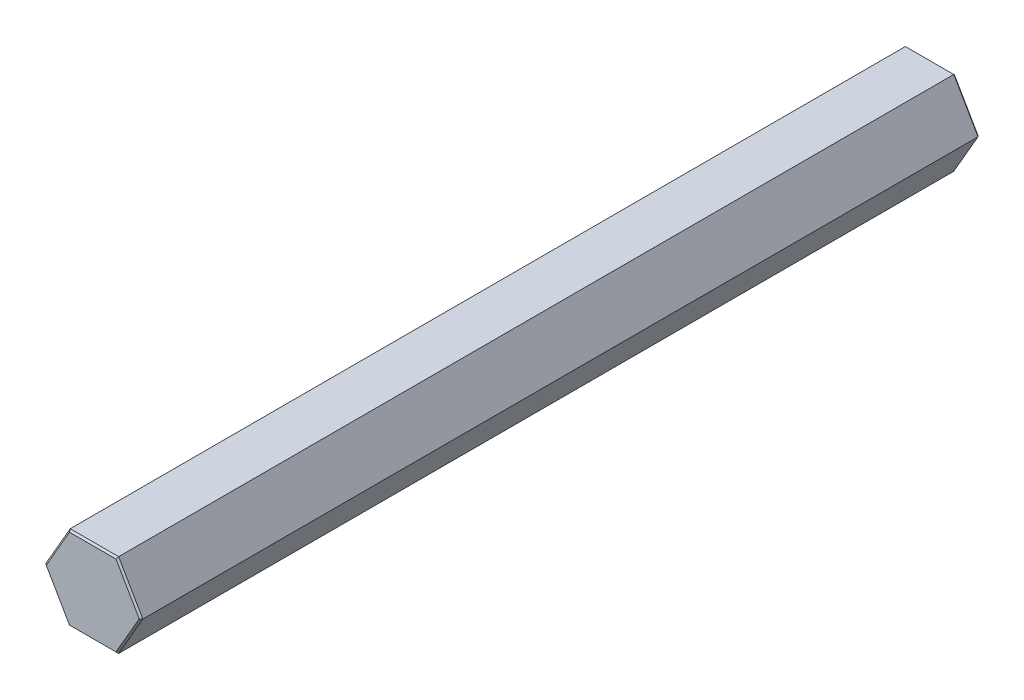
ISO-10303-21;
HEADER;
FILE_DESCRIPTION(('STEP AP214'),'2;1');
FILE_NAME('part.step','',(''),(''),'','','');
FILE_SCHEMA(('AUTOMOTIVE_DESIGN { 1 0 10303 214 1 1 1 1 }'));
ENDSEC;
DATA;
#1=APPLICATION_CONTEXT('core data for automotive mechanical design processes');
#2=APPLICATION_PROTOCOL_DEFINITION('international standard','automotive_design',2000,#1);
#3=PRODUCT_CONTEXT('',#1,'mechanical');
#4=PRODUCT('Part','Part','',(#3));
#5=PRODUCT_RELATED_PRODUCT_CATEGORY('part','',(#4));
#6=PRODUCT_DEFINITION_FORMATION('','',#4);
#7=PRODUCT_DEFINITION_CONTEXT('part definition',#1,'design');
#8=PRODUCT_DEFINITION('design','',#6,#7);
#9=PRODUCT_DEFINITION_SHAPE('','',#8);
#10=(LENGTH_UNIT() NAMED_UNIT(*) SI_UNIT(.MILLI.,.METRE.));
#11=(NAMED_UNIT(*) PLANE_ANGLE_UNIT() SI_UNIT($,.RADIAN.));
#12=(NAMED_UNIT(*) SI_UNIT($,.STERADIAN.) SOLID_ANGLE_UNIT());
#13=UNCERTAINTY_MEASURE_WITH_UNIT(LENGTH_MEASURE(1.E-05),#10,'distance_accuracy_value','');
#14=(GEOMETRIC_REPRESENTATION_CONTEXT(3) GLOBAL_UNCERTAINTY_ASSIGNED_CONTEXT((#13)) GLOBAL_UNIT_ASSIGNED_CONTEXT((#10,
#11,#12)) REPRESENTATION_CONTEXT('',''));
#15=CARTESIAN_POINT('',(0.,0.,0.));
#16=DIRECTION('',(0.,0.,1.));
#17=DIRECTION('',(1.,0.,0.));
#18=AXIS2_PLACEMENT_3D('',#15,#16,#17);
#19=CARTESIAN_POINT('',(7.11237796614698,0.127000000000015,127.));
#20=DIRECTION('',(0.612372435695803,-0.353553390593279,0.707106781186538));
#21=DIRECTION('',(-0.5,-0.866025403784439,0.));
#22=AXIS2_PLACEMENT_3D('',#19,#20,#21);
#23=PLANE('',#22);
#24=DIRECTION('',(0.377964473009223,-0.65465367070797,-0.654653670707987));
#25=VECTOR('',#24,1.);
#26=CARTESIAN_POINT('',(4.06421598065541,-7.03942857142853,126.056571428571));
#27=LINE('',#26,#25);
#28=CARTESIAN_POINT('',(3.51952724097994,-6.096,127.));
#29=VERTEX_POINT('',#28);
#30=CARTESIAN_POINT('',(3.66617420935412,-6.35,126.746));
#31=VERTEX_POINT('',#30);
#32=EDGE_CURVE('E31',#29,#31,#27,.T.);
#33=ORIENTED_EDGE('',*,*,#32,.T.);
#34=DIRECTION('',(-0.5,-0.866025403784439,0.));
#35=VECTOR('',#34,1.);
#36=CARTESIAN_POINT('',(3.66617420935412,-6.35,126.746));
#37=LINE('',#36,#35);
#38=CARTESIAN_POINT('',(7.33234841870825,0.,126.746));
#39=VERTEX_POINT('',#38);
#40=EDGE_CURVE('E216',#39,#31,#37,.T.);
#41=ORIENTED_EDGE('',*,*,#40,.F.);
#42=DIRECTION('',(-0.755928946018446,0.,0.654653670707987));
#43=VECTOR('',#42,1.);
#44=CARTESIAN_POINT('',(7.08095361578108,0.,126.963714285714));
#45=LINE('',#44,#43);
#46=CARTESIAN_POINT('',(7.03905448195989,0.,127.));
#47=VERTEX_POINT('',#46);
#48=EDGE_CURVE('E12',#39,#47,#45,.T.);
#49=ORIENTED_EDGE('',*,*,#48,.T.);
#50=DIRECTION('',(0.5,0.866025403784439,0.));
#51=VECTOR('',#50,1.);
#52=CARTESIAN_POINT('',(7.11237796614698,0.127000000000014,127.));
#53=LINE('',#52,#51);
#54=EDGE_CURVE('E184',#29,#47,#53,.T.);
#55=ORIENTED_EDGE('',*,*,#54,.F.);
#56=EDGE_LOOP('',(#33,#41,#49,#55));
#57=FACE_BOUND('',#56,.T.);
#58=ADVANCED_FACE('F20',(#57),#23,.T.);
#59=CARTESIAN_POINT('',(7.11237796614698,-0.12700000000001,127.));
#60=DIRECTION('',(0.612372435695803,0.35355339059328,0.707106781186537));
#61=DIRECTION('',(0.5,-0.866025403784438,0.));
#62=AXIS2_PLACEMENT_3D('',#59,#60,#61);
#63=PLANE('',#62);
#64=DIRECTION('',(-0.377964473009222,-0.65465367070797,0.654653670707988));
#65=VECTOR('',#64,1.);
#66=CARTESIAN_POINT('',(2.49299846236082,4.318,128.778));
#67=LINE('',#66,#65);
#68=CARTESIAN_POINT('',(3.66617420935412,6.35,126.746));
#69=VERTEX_POINT('',#68);
#70=CARTESIAN_POINT('',(3.51952724097994,6.096,127.));
#71=VERTEX_POINT('',#70);
#72=EDGE_CURVE('E23',#69,#71,#67,.T.);
#73=ORIENTED_EDGE('',*,*,#72,.T.);
#74=DIRECTION('',(-0.5,0.866025403784438,0.));
#75=VECTOR('',#74,1.);
#76=CARTESIAN_POINT('',(3.44620375679286,6.223,127.));
#77=LINE('',#76,#75);
#78=EDGE_CURVE('E190',#47,#71,#77,.T.);
#79=ORIENTED_EDGE('',*,*,#78,.F.);
#80=ORIENTED_EDGE('',*,*,#48,.F.);
#81=DIRECTION('',(0.5,-0.866025403784438,0.));
#82=VECTOR('',#81,1.);
#83=CARTESIAN_POINT('',(7.33234841870825,0.,126.746));
#84=LINE('',#83,#82);
#85=EDGE_CURVE('E259',#69,#39,#84,.T.);
#86=ORIENTED_EDGE('',*,*,#85,.F.);
#87=EDGE_LOOP('',(#73,#79,#80,#86));
#88=FACE_BOUND('',#87,.T.);
#89=ADVANCED_FACE('F468',(#88),#63,.T.);
#90=CARTESIAN_POINT('',(7.33234841870825,-6.096,127.));
#91=DIRECTION('',(0.,-0.707106781186557,0.707106781186538));
#92=DIRECTION('',(-1.,0.,0.));
#93=AXIS2_PLACEMENT_3D('',#90,#91,#92);
#94=PLANE('',#93);
#95=DIRECTION('',(-0.37796447300922,-0.654653670707971,-0.654653670707988));
#96=VECTOR('',#95,1.);
#97=CARTESIAN_POINT('',(-3.54047680789054,-6.13228571428569,126.963714285714));
#98=LINE('',#97,#96);
#99=CARTESIAN_POINT('',(-3.51952724097994,-6.096,127.));
#100=VERTEX_POINT('',#99);
#101=CARTESIAN_POINT('',(-3.66617420935412,-6.35,126.746));
#102=VERTEX_POINT('',#101);
#103=EDGE_CURVE('E250',#100,#102,#98,.T.);
#104=ORIENTED_EDGE('',*,*,#103,.T.);
#105=DIRECTION('',(-1.,0.,0.));
#106=VECTOR('',#105,1.);
#107=CARTESIAN_POINT('',(-3.66617420935412,-6.35,126.746));
#108=LINE('',#107,#106);
#109=EDGE_CURVE('E185',#31,#102,#108,.T.);
#110=ORIENTED_EDGE('',*,*,#109,.F.);
#111=ORIENTED_EDGE('',*,*,#32,.F.);
#112=DIRECTION('',(1.,0.,0.));
#113=VECTOR('',#112,1.);
#114=CARTESIAN_POINT('',(3.66617420935412,-6.096,127.));
#115=LINE('',#114,#113);
#116=EDGE_CURVE('E179',#100,#29,#115,.T.);
#117=ORIENTED_EDGE('',*,*,#116,.F.);
#118=EDGE_LOOP('',(#104,#110,#111,#117));
#119=FACE_BOUND('',#118,.T.);
#120=ADVANCED_FACE('F457',(#119),#94,.T.);
#121=CARTESIAN_POINT('',(7.33234841870825,6.096,127.));
#122=DIRECTION('',(0.,0.707106781186557,0.707106781186538));
#123=DIRECTION('',(1.,0.,0.));
#124=AXIS2_PLACEMENT_3D('',#121,#122,#123);
#125=PLANE('',#124);
#126=DIRECTION('',(0.377964473009222,-0.65465367070797,0.654653670707988));
#127=VECTOR('',#126,1.);
#128=CARTESIAN_POINT('',(-1.96925928959596,3.41085714285719,129.685142857143));
#129=LINE('',#128,#127);
#130=CARTESIAN_POINT('',(-3.66617420935412,6.35,126.746));
#131=VERTEX_POINT('',#130);
#132=CARTESIAN_POINT('',(-3.51952724097994,6.096,127.));
#133=VERTEX_POINT('',#132);
#134=EDGE_CURVE('E141',#131,#133,#129,.T.);
#135=ORIENTED_EDGE('',*,*,#134,.T.);
#136=DIRECTION('',(-1.,0.,0.));
#137=VECTOR('',#136,1.);
#138=CARTESIAN_POINT('',(-3.66617420935412,6.096,127.));
#139=LINE('',#138,#137);
#140=EDGE_CURVE('E196',#71,#133,#139,.T.);
#141=ORIENTED_EDGE('',*,*,#140,.F.);
#142=ORIENTED_EDGE('',*,*,#72,.F.);
#143=DIRECTION('',(1.,0.,0.));
#144=VECTOR('',#143,1.);
#145=CARTESIAN_POINT('',(3.66617420935412,6.35,126.746));
#146=LINE('',#145,#144);
#147=EDGE_CURVE('E186',#131,#69,#146,.T.);
#148=ORIENTED_EDGE('',*,*,#147,.F.);
#149=EDGE_LOOP('',(#135,#141,#142,#148));
#150=FACE_BOUND('',#149,.T.);
#151=ADVANCED_FACE('F452',(#150),#125,.T.);
#152=CARTESIAN_POINT('',(-3.44620375679285,-6.223,127.));
#153=DIRECTION('',(-0.612372435695804,-0.35355339059328,0.707106781186537));
#154=DIRECTION('',(-0.5,0.866025403784439,0.));
#155=AXIS2_PLACEMENT_3D('',#152,#153,#154);
#156=PLANE('',#155);
#157=DIRECTION('',(-0.755928946018445,0.,-0.654653670707988));
#158=VECTOR('',#157,1.);
#159=CARTESIAN_POINT('',(-4.98599692472164,0.,128.778));
#160=LINE('',#159,#158);
#161=CARTESIAN_POINT('',(-7.03905448195989,0.,127.));
#162=VERTEX_POINT('',#161);
#163=CARTESIAN_POINT('',(-7.33234841870824,0.,126.746));
#164=VERTEX_POINT('',#163);
#165=EDGE_CURVE('E246',#162,#164,#160,.T.);
#166=ORIENTED_EDGE('',*,*,#165,.T.);
#167=DIRECTION('',(-0.5,0.866025403784439,0.));
#168=VECTOR('',#167,1.);
#169=CARTESIAN_POINT('',(-7.33234841870824,0.,126.746));
#170=LINE('',#169,#168);
#171=EDGE_CURVE('E206',#102,#164,#170,.T.);
#172=ORIENTED_EDGE('',*,*,#171,.F.);
#173=ORIENTED_EDGE('',*,*,#103,.F.);
#174=DIRECTION('',(0.5,-0.866025403784439,0.));
#175=VECTOR('',#174,1.);
#176=CARTESIAN_POINT('',(-3.44620375679285,-6.223,127.));
#177=LINE('',#176,#175);
#178=EDGE_CURVE('E156',#162,#100,#177,.T.);
#179=ORIENTED_EDGE('',*,*,#178,.F.);
#180=EDGE_LOOP('',(#166,#172,#173,#179));
#181=FACE_BOUND('',#180,.T.);
#182=ADVANCED_FACE('F456',(#181),#156,.T.);
#183=CARTESIAN_POINT('',(-3.44620375679285,6.223,127.));
#184=DIRECTION('',(-0.612372435695804,0.353553390593279,0.707106781186537));
#185=DIRECTION('',(0.5,0.866025403784439,0.));
#186=AXIS2_PLACEMENT_3D('',#183,#184,#185);
#187=PLANE('',#186);
#188=ORIENTED_EDGE('',*,*,#134,.F.);
#189=DIRECTION('',(0.5,0.866025403784439,0.));
#190=VECTOR('',#189,1.);
#191=CARTESIAN_POINT('',(-3.66617420935412,6.35,126.746));
#192=LINE('',#191,#190);
#193=EDGE_CURVE('E273',#164,#131,#192,.T.);
#194=ORIENTED_EDGE('',*,*,#193,.F.);
#195=ORIENTED_EDGE('',*,*,#165,.F.);
#196=DIRECTION('',(-0.5,-0.866025403784439,0.));
#197=VECTOR('',#196,1.);
#198=CARTESIAN_POINT('',(-7.11237796614697,-0.127000000000013,127.));
#199=LINE('',#198,#197);
#200=EDGE_CURVE('E162',#133,#162,#199,.T.);
#201=ORIENTED_EDGE('',*,*,#200,.F.);
#202=EDGE_LOOP('',(#188,#194,#195,#201));
#203=FACE_BOUND('',#202,.T.);
#204=ADVANCED_FACE('F558',(#203),#187,.T.);
#205=CARTESIAN_POINT('',(7.33234841870825,0.,0.253999999999977));
#206=DIRECTION('',(-0.612372435695778,-0.353553390593265,0.707106781186566));
#207=DIRECTION('',(-0.5,0.866025403784439,0.));
#208=AXIS2_PLACEMENT_3D('',#205,#206,#207);
#209=PLANE('',#208);
#210=DIRECTION('',(-0.755928946018472,0.,-0.654653670707957));
#211=VECTOR('',#210,1.);
#212=CARTESIAN_POINT('',(5.23739172764866,0.,-1.56028571428572));
#213=LINE('',#212,#211);
#214=CARTESIAN_POINT('',(7.33234841870825,0.,0.253999999999977));
#215=VERTEX_POINT('',#214);
#216=CARTESIAN_POINT('',(7.03905448195993,0.,0.));
#217=VERTEX_POINT('',#216);
#218=EDGE_CURVE('E123',#215,#217,#213,.T.);
#219=ORIENTED_EDGE('',*,*,#218,.T.);
#220=DIRECTION('',(0.5,-0.866025403784438,0.));
#221=VECTOR('',#220,1.);
#222=CARTESIAN_POINT('',(7.11237796614701,-0.126999999999992,0.));
#223=LINE('',#222,#221);
#224=CARTESIAN_POINT('',(3.51952724097996,6.096,0.));
#225=VERTEX_POINT('',#224);
#226=EDGE_CURVE('E144',#225,#217,#223,.T.);
#227=ORIENTED_EDGE('',*,*,#226,.F.);
#228=DIRECTION('',(0.377964473009236,0.654653670707991,0.654653670707958));
#229=VECTOR('',#228,1.);
#230=CARTESIAN_POINT('',(3.66617420935412,6.35,0.253999999999977));
#231=LINE('',#230,#229);
#232=CARTESIAN_POINT('',(3.66617420935412,6.35,0.253999999999977));
#233=VERTEX_POINT('',#232);
#234=EDGE_CURVE('E133',#225,#233,#231,.T.);
#235=ORIENTED_EDGE('',*,*,#234,.T.);
#236=DIRECTION('',(-0.5,0.866025403784438,0.));
#237=VECTOR('',#236,1.);
#238=CARTESIAN_POINT('',(7.33234841870825,0.,0.253999999999977));
#239=LINE('',#238,#237);
#240=EDGE_CURVE('E220',#215,#233,#239,.T.);
#241=ORIENTED_EDGE('',*,*,#240,.F.);
#242=EDGE_LOOP('',(#219,#227,#235,#241));
#243=FACE_BOUND('',#242,.T.);
#244=ADVANCED_FACE('F145',(#243),#209,.F.);
#245=CARTESIAN_POINT('',(3.66617420935412,6.35,0.253999999999977));
#246=DIRECTION('',(0.,-0.70710678118653,0.707106781186566));
#247=DIRECTION('',(-1.,0.,0.));
#248=AXIS2_PLACEMENT_3D('',#245,#246,#247);
#249=PLANE('',#248);
#250=DIRECTION('',(-0.377964473009238,0.654653670707991,0.654653670707957));
#251=VECTOR('',#250,1.);
#252=CARTESIAN_POINT('',(-3.66617420935412,6.35,0.253999999999977));
#253=LINE('',#252,#251);
#254=CARTESIAN_POINT('',(-3.51952724097996,6.096,0.));
#255=VERTEX_POINT('',#254);
#256=CARTESIAN_POINT('',(-3.66617420935412,6.35,0.253999999999977));
#257=VERTEX_POINT('',#256);
#258=EDGE_CURVE('E236',#255,#257,#253,.T.);
#259=ORIENTED_EDGE('',*,*,#258,.T.);
#260=DIRECTION('',(-1.,0.,0.));
#261=VECTOR('',#260,1.);
#262=CARTESIAN_POINT('',(3.66617420935412,6.35,0.253999999999977));
#263=LINE('',#262,#261);
#264=EDGE_CURVE('E138',#233,#257,#263,.T.);
#265=ORIENTED_EDGE('',*,*,#264,.F.);
#266=ORIENTED_EDGE('',*,*,#234,.F.);
#267=DIRECTION('',(1.,0.,0.));
#268=VECTOR('',#267,1.);
#269=CARTESIAN_POINT('',(7.33234841870825,6.096,0.));
#270=LINE('',#269,#268);
#271=EDGE_CURVE('E136',#255,#225,#270,.T.);
#272=ORIENTED_EDGE('',*,*,#271,.F.);
#273=EDGE_LOOP('',(#259,#265,#266,#272));
#274=FACE_BOUND('',#273,.T.);
#275=ADVANCED_FACE('F134',(#274),#249,.F.);
#276=CARTESIAN_POINT('',(3.66617420935412,-6.35,0.253999999999977));
#277=DIRECTION('',(-0.612372435695778,0.353553390593264,0.707106781186567));
#278=DIRECTION('',(0.5,0.866025403784439,0.));
#279=AXIS2_PLACEMENT_3D('',#276,#277,#278);
#280=PLANE('',#279);
#281=DIRECTION('',(-0.377964473009236,0.654653670707993,-0.654653670707956));
#282=VECTOR('',#281,1.);
#283=CARTESIAN_POINT('',(3.66617420935412,-6.35,0.253999999999977));
#284=LINE('',#283,#282);
#285=CARTESIAN_POINT('',(3.66617420935412,-6.35,0.253999999999977));
#286=VERTEX_POINT('',#285);
#287=CARTESIAN_POINT('',(3.51952724097996,-6.096,0.));
#288=VERTEX_POINT('',#287);
#289=EDGE_CURVE('E232',#286,#288,#284,.T.);
#290=ORIENTED_EDGE('',*,*,#289,.T.);
#291=DIRECTION('',(-0.5,-0.866025403784439,0.));
#292=VECTOR('',#291,1.);
#293=CARTESIAN_POINT('',(7.11237796614701,0.126999999999997,0.));
#294=LINE('',#293,#292);
#295=EDGE_CURVE('E149',#217,#288,#294,.T.);
#296=ORIENTED_EDGE('',*,*,#295,.F.);
#297=ORIENTED_EDGE('',*,*,#218,.F.);
#298=DIRECTION('',(0.5,0.866025403784439,0.));
#299=VECTOR('',#298,1.);
#300=CARTESIAN_POINT('',(3.66617420935412,-6.35,0.253999999999977));
#301=LINE('',#300,#299);
#302=EDGE_CURVE('E267',#286,#215,#301,.T.);
#303=ORIENTED_EDGE('',*,*,#302,.F.);
#304=EDGE_LOOP('',(#290,#296,#297,#303));
#305=FACE_BOUND('',#304,.T.);
#306=ADVANCED_FACE('F415',(#305),#280,.F.);
#307=CARTESIAN_POINT('',(-3.66617420935412,6.35,0.253999999999977));
#308=DIRECTION('',(0.612372435695778,-0.353553390593264,0.707106781186567));
#309=DIRECTION('',(-0.5,-0.866025403784439,0.));
#310=AXIS2_PLACEMENT_3D('',#307,#308,#309);
#311=PLANE('',#310);
#312=DIRECTION('',(-0.755928946018472,0.,0.654653670707957));
#313=VECTOR('',#312,1.);
#314=CARTESIAN_POINT('',(-7.33234841870824,0.,0.253999999999977));
#315=LINE('',#314,#313);
#316=CARTESIAN_POINT('',(-7.03905448195993,0.,0.));
#317=VERTEX_POINT('',#316);
#318=CARTESIAN_POINT('',(-7.33234841870824,0.,0.253999999999977));
#319=VERTEX_POINT('',#318);
#320=EDGE_CURVE('E46',#317,#319,#315,.T.);
#321=ORIENTED_EDGE('',*,*,#320,.T.);
#322=DIRECTION('',(-0.5,-0.866025403784439,0.));
#323=VECTOR('',#322,1.);
#324=CARTESIAN_POINT('',(-3.66617420935412,6.35,0.253999999999977));
#325=LINE('',#324,#323);
#326=EDGE_CURVE('E168',#257,#319,#325,.T.);
#327=ORIENTED_EDGE('',*,*,#326,.F.);
#328=ORIENTED_EDGE('',*,*,#258,.F.);
#329=DIRECTION('',(0.5,0.866025403784439,0.));
#330=VECTOR('',#329,1.);
#331=CARTESIAN_POINT('',(-3.44620375679288,6.223,0.));
#332=LINE('',#331,#330);
#333=EDGE_CURVE('E154',#317,#255,#332,.T.);
#334=ORIENTED_EDGE('',*,*,#333,.F.);
#335=EDGE_LOOP('',(#321,#327,#328,#334));
#336=FACE_BOUND('',#335,.T.);
#337=ADVANCED_FACE('F301',(#336),#311,.F.);
#338=CARTESIAN_POINT('',(-3.66617420935412,-6.35,0.253999999999977));
#339=DIRECTION('',(0.,0.707106781186528,0.707106781186567));
#340=DIRECTION('',(1.,0.,0.));
#341=AXIS2_PLACEMENT_3D('',#338,#339,#340);
#342=PLANE('',#341);
#343=DIRECTION('',(0.377964473009234,0.654653670707994,-0.654653670707957));
#344=VECTOR('',#343,1.);
#345=CARTESIAN_POINT('',(-3.66617420935412,-6.35,0.253999999999977));
#346=LINE('',#345,#344);
#347=CARTESIAN_POINT('',(-3.66617420935412,-6.35,0.253999999999977));
#348=VERTEX_POINT('',#347);
#349=CARTESIAN_POINT('',(-3.51952724097996,-6.096,0.));
#350=VERTEX_POINT('',#349);
#351=EDGE_CURVE('E225',#348,#350,#346,.T.);
#352=ORIENTED_EDGE('',*,*,#351,.T.);
#353=DIRECTION('',(-1.,0.,0.));
#354=VECTOR('',#353,1.);
#355=CARTESIAN_POINT('',(7.33234841870825,-6.096,0.));
#356=LINE('',#355,#354);
#357=EDGE_CURVE('E226',#288,#350,#356,.T.);
#358=ORIENTED_EDGE('',*,*,#357,.F.);
#359=ORIENTED_EDGE('',*,*,#289,.F.);
#360=DIRECTION('',(1.,0.,0.));
#361=VECTOR('',#360,1.);
#362=CARTESIAN_POINT('',(-3.66617420935412,-6.35,0.253999999999977));
#363=LINE('',#362,#361);
#364=EDGE_CURVE('E209',#348,#286,#363,.T.);
#365=ORIENTED_EDGE('',*,*,#364,.F.);
#366=EDGE_LOOP('',(#352,#358,#359,#365));
#367=FACE_BOUND('',#366,.T.);
#368=ADVANCED_FACE('F414',(#367),#342,.F.);
#369=CARTESIAN_POINT('',(-7.33234841870824,0.,0.253999999999977));
#370=DIRECTION('',(0.612372435695778,0.353553390593265,0.707106781186566));
#371=DIRECTION('',(0.5,-0.866025403784439,0.));
#372=AXIS2_PLACEMENT_3D('',#369,#370,#371);
#373=PLANE('',#372);
#374=ORIENTED_EDGE('',*,*,#320,.F.);
#375=DIRECTION('',(-0.5,0.866025403784439,0.));
#376=VECTOR('',#375,1.);
#377=CARTESIAN_POINT('',(-3.44620375679288,-6.223,0.));
#378=LINE('',#377,#376);
#379=EDGE_CURVE('E205',#350,#317,#378,.T.);
#380=ORIENTED_EDGE('',*,*,#379,.F.);
#381=ORIENTED_EDGE('',*,*,#351,.F.);
#382=DIRECTION('',(0.5,-0.866025403784439,0.));
#383=VECTOR('',#382,1.);
#384=CARTESIAN_POINT('',(-7.33234841870824,0.,0.253999999999977));
#385=LINE('',#384,#383);
#386=EDGE_CURVE('E215',#319,#348,#385,.T.);
#387=ORIENTED_EDGE('',*,*,#386,.F.);
#388=EDGE_LOOP('',(#374,#380,#381,#387));
#389=FACE_BOUND('',#388,.T.);
#390=ADVANCED_FACE('F479',(#389),#373,.F.);
#391=CARTESIAN_POINT('',(7.33234841870825,0.,0.));
#392=DIRECTION('',(0.,0.,1.));
#393=DIRECTION('',(1.,0.,0.));
#394=AXIS2_PLACEMENT_3D('',#391,#392,#393);
#395=PLANE('',#394);
#396=ORIENTED_EDGE('',*,*,#271,.T.);
#397=ORIENTED_EDGE('',*,*,#226,.T.);
#398=ORIENTED_EDGE('',*,*,#295,.T.);
#399=ORIENTED_EDGE('',*,*,#357,.T.);
#400=ORIENTED_EDGE('',*,*,#379,.T.);
#401=ORIENTED_EDGE('',*,*,#333,.T.);
#402=EDGE_LOOP('',(#396,#397,#398,#399,#400,#401));
#403=FACE_BOUND('',#402,.T.);
#404=ADVANCED_FACE('F152',(#403),#395,.F.);
#405=CARTESIAN_POINT('',(7.33234841870825,0.,127.));
#406=DIRECTION('',(0.,0.,1.));
#407=DIRECTION('',(1.,0.,0.));
#408=AXIS2_PLACEMENT_3D('',#405,#406,#407);
#409=PLANE('',#408);
#410=ORIENTED_EDGE('',*,*,#116,.T.);
#411=ORIENTED_EDGE('',*,*,#54,.T.);
#412=ORIENTED_EDGE('',*,*,#78,.T.);
#413=ORIENTED_EDGE('',*,*,#140,.T.);
#414=ORIENTED_EDGE('',*,*,#200,.T.);
#415=ORIENTED_EDGE('',*,*,#178,.T.);
#416=EDGE_LOOP('',(#410,#411,#412,#413,#414,#415));
#417=FACE_BOUND('',#416,.T.);
#418=ADVANCED_FACE('F490',(#417),#409,.T.);
#419=CARTESIAN_POINT('',(-3.66617420935412,-6.35,127.));
#420=DIRECTION('',(0.,1.,0.));
#421=DIRECTION('',(1.,0.,0.));
#422=AXIS2_PLACEMENT_3D('',#419,#420,#421);
#423=PLANE('',#422);
#424=DIRECTION('',(0.,0.,-1.));
#425=VECTOR('',#424,1.);
#426=CARTESIAN_POINT('',(-3.66617420935412,-6.35,127.));
#427=LINE('',#426,#425);
#428=EDGE_CURVE('E210',#102,#348,#427,.T.);
#429=ORIENTED_EDGE('',*,*,#428,.T.);
#430=ORIENTED_EDGE('',*,*,#364,.T.);
#431=DIRECTION('',(0.,0.,-1.));
#432=VECTOR('',#431,1.);
#433=CARTESIAN_POINT('',(3.66617420935412,-6.35,127.));
#434=LINE('',#433,#432);
#435=EDGE_CURVE('E276',#31,#286,#434,.T.);
#436=ORIENTED_EDGE('',*,*,#435,.F.);
#437=ORIENTED_EDGE('',*,*,#109,.T.);
#438=EDGE_LOOP('',(#429,#430,#436,#437));
#439=FACE_BOUND('',#438,.T.);
#440=ADVANCED_FACE('F402',(#439),#423,.F.);
#441=CARTESIAN_POINT('',(-7.33234841870824,0.,127.));
#442=DIRECTION('',(0.866025403784439,0.5,0.));
#443=DIRECTION('',(0.,0.,-1.));
#444=AXIS2_PLACEMENT_3D('',#441,#442,#443);
#445=PLANE('',#444);
#446=DIRECTION('',(0.,0.,-1.));
#447=VECTOR('',#446,1.);
#448=CARTESIAN_POINT('',(-7.33234841870824,0.,127.));
#449=LINE('',#448,#447);
#450=EDGE_CURVE('E268',#164,#319,#449,.T.);
#451=ORIENTED_EDGE('',*,*,#450,.T.);
#452=ORIENTED_EDGE('',*,*,#386,.T.);
#453=ORIENTED_EDGE('',*,*,#428,.F.);
#454=ORIENTED_EDGE('',*,*,#171,.T.);
#455=EDGE_LOOP('',(#451,#452,#453,#454));
#456=FACE_BOUND('',#455,.T.);
#457=ADVANCED_FACE('F397',(#456),#445,.F.);
#458=CARTESIAN_POINT('',(-3.66617420935412,6.35,127.));
#459=DIRECTION('',(0.866025403784439,-0.5,0.));
#460=DIRECTION('',(0.,0.,-1.));
#461=AXIS2_PLACEMENT_3D('',#458,#459,#460);
#462=PLANE('',#461);
#463=DIRECTION('',(0.,0.,-1.));
#464=VECTOR('',#463,1.);
#465=CARTESIAN_POINT('',(-3.66617420935412,6.35,127.));
#466=LINE('',#465,#464);
#467=EDGE_CURVE('E306',#131,#257,#466,.T.);
#468=ORIENTED_EDGE('',*,*,#467,.T.);
#469=ORIENTED_EDGE('',*,*,#326,.T.);
#470=ORIENTED_EDGE('',*,*,#450,.F.);
#471=ORIENTED_EDGE('',*,*,#193,.T.);
#472=EDGE_LOOP('',(#468,#469,#470,#471));
#473=FACE_BOUND('',#472,.T.);
#474=ADVANCED_FACE('F307',(#473),#462,.F.);
#475=CARTESIAN_POINT('',(3.66617420935412,6.35,127.));
#476=DIRECTION('',(0.,-1.,0.));
#477=DIRECTION('',(0.,0.,-1.));
#478=AXIS2_PLACEMENT_3D('',#475,#476,#477);
#479=PLANE('',#478);
#480=DIRECTION('',(0.,0.,-1.));
#481=VECTOR('',#480,1.);
#482=CARTESIAN_POINT('',(3.66617420935412,6.35,127.));
#483=LINE('',#482,#481);
#484=EDGE_CURVE('E256',#69,#233,#483,.T.);
#485=ORIENTED_EDGE('',*,*,#484,.T.);
#486=ORIENTED_EDGE('',*,*,#264,.T.);
#487=ORIENTED_EDGE('',*,*,#467,.F.);
#488=ORIENTED_EDGE('',*,*,#147,.T.);
#489=EDGE_LOOP('',(#485,#486,#487,#488));
#490=FACE_BOUND('',#489,.T.);
#491=ADVANCED_FACE('F313',(#490),#479,.F.);
#492=CARTESIAN_POINT('',(7.33234841870825,0.,127.));
#493=DIRECTION('',(-0.866025403784439,-0.5,0.));
#494=DIRECTION('',(-0.5,0.866025403784439,0.));
#495=AXIS2_PLACEMENT_3D('',#492,#493,#494);
#496=PLANE('',#495);
#497=DIRECTION('',(0.,0.,-1.));
#498=VECTOR('',#497,1.);
#499=CARTESIAN_POINT('',(7.33234841870825,0.,127.));
#500=LINE('',#499,#498);
#501=EDGE_CURVE('E221',#39,#215,#500,.T.);
#502=ORIENTED_EDGE('',*,*,#501,.T.);
#503=ORIENTED_EDGE('',*,*,#240,.T.);
#504=ORIENTED_EDGE('',*,*,#484,.F.);
#505=ORIENTED_EDGE('',*,*,#85,.T.);
#506=EDGE_LOOP('',(#502,#503,#504,#505));
#507=FACE_BOUND('',#506,.T.);
#508=ADVANCED_FACE('F426',(#507),#496,.F.);
#509=CARTESIAN_POINT('',(3.66617420935412,-6.35,127.));
#510=DIRECTION('',(-0.866025403784439,0.5,0.));
#511=DIRECTION('',(0.,0.,1.));
#512=AXIS2_PLACEMENT_3D('',#509,#510,#511);
#513=PLANE('',#512);
#514=ORIENTED_EDGE('',*,*,#435,.T.);
#515=ORIENTED_EDGE('',*,*,#302,.T.);
#516=ORIENTED_EDGE('',*,*,#501,.F.);
#517=ORIENTED_EDGE('',*,*,#40,.T.);
#518=EDGE_LOOP('',(#514,#515,#516,#517));
#519=FACE_BOUND('',#518,.T.);
#520=ADVANCED_FACE('F422',(#519),#513,.F.);
#521=CLOSED_SHELL('',(#58,#89,#120,#151,#182,#204,#244,#275,#306,#337,#368,#390,#404,#418,#440,
#457,#474,#491,#508,#520));
#522=MANIFOLD_SOLID_BREP('B1',#521);
#523=ADVANCED_BREP_SHAPE_REPRESENTATION('',(#18,#522),#14);
#524=SHAPE_DEFINITION_REPRESENTATION(#9,#523);
ENDSEC;
END-ISO-10303-21;
